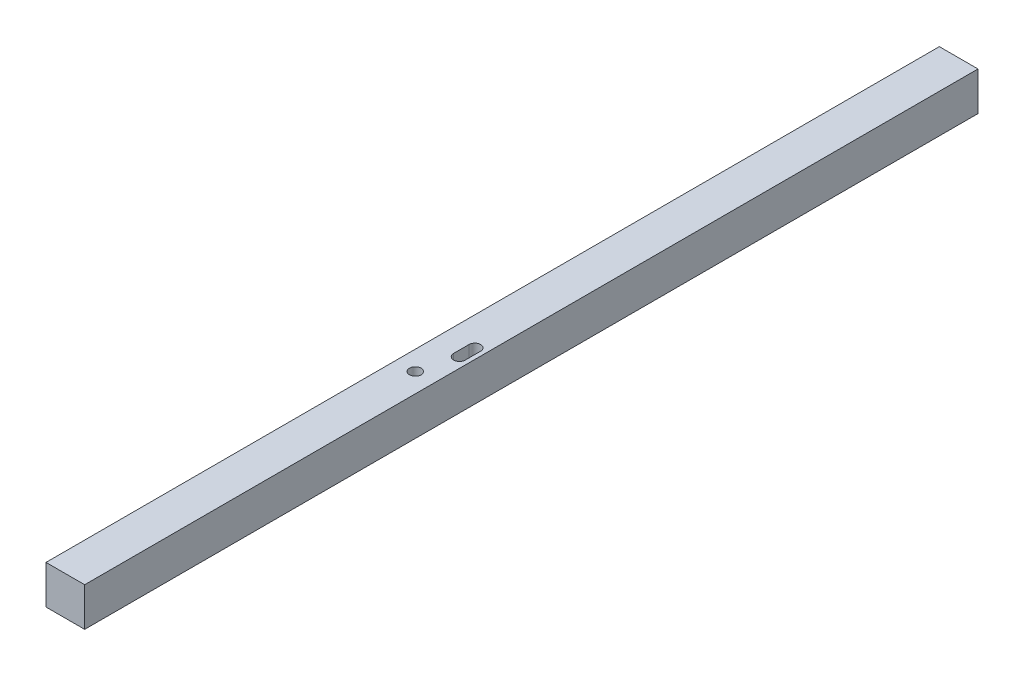
ISO-10303-21;
HEADER;
FILE_DESCRIPTION(('STEP AP214'),'2;1');
FILE_NAME('part.step','',(''),(''),'','','');
FILE_SCHEMA(('AUTOMOTIVE_DESIGN { 1 0 10303 214 1 1 1 1 }'));
ENDSEC;
DATA;
#1=APPLICATION_CONTEXT('core data for automotive mechanical design processes');
#2=APPLICATION_PROTOCOL_DEFINITION('international standard','automotive_design',2000,#1);
#3=PRODUCT_CONTEXT('',#1,'mechanical');
#4=PRODUCT('Part','Part','',(#3));
#5=PRODUCT_RELATED_PRODUCT_CATEGORY('part','',(#4));
#6=PRODUCT_DEFINITION_FORMATION('','',#4);
#7=PRODUCT_DEFINITION_CONTEXT('part definition',#1,'design');
#8=PRODUCT_DEFINITION('design','',#6,#7);
#9=PRODUCT_DEFINITION_SHAPE('','',#8);
#10=(LENGTH_UNIT() NAMED_UNIT(*) SI_UNIT(.MILLI.,.METRE.));
#11=(NAMED_UNIT(*) PLANE_ANGLE_UNIT() SI_UNIT($,.RADIAN.));
#12=(NAMED_UNIT(*) SI_UNIT($,.STERADIAN.) SOLID_ANGLE_UNIT());
#13=UNCERTAINTY_MEASURE_WITH_UNIT(LENGTH_MEASURE(1.E-05),#10,'distance_accuracy_value','');
#14=(GEOMETRIC_REPRESENTATION_CONTEXT(3) GLOBAL_UNCERTAINTY_ASSIGNED_CONTEXT((#13)) GLOBAL_UNIT_ASSIGNED_CONTEXT((#10,
#11,#12)) REPRESENTATION_CONTEXT('',''));
#15=CARTESIAN_POINT('',(0.,0.,0.));
#16=DIRECTION('',(0.,0.,1.));
#17=DIRECTION('',(1.,0.,0.));
#18=AXIS2_PLACEMENT_3D('',#15,#16,#17);
#19=CARTESIAN_POINT('',(-5.,5.,131.642135623731));
#20=DIRECTION('',(0.,-1.,0.));
#21=DIRECTION('',(0.,0.,-1.));
#22=AXIS2_PLACEMENT_3D('',#19,#20,#21);
#23=PLANE('',#22);
#24=DIRECTION('',(0.,0.,-1.));
#25=VECTOR('',#24,1.);
#26=CARTESIAN_POINT('',(0.899999999999777,5.,12.));
#27=LINE('',#26,#25);
#28=CARTESIAN_POINT('',(0.899999999999777,5.,16.));
#29=VERTEX_POINT('',#28);
#30=CARTESIAN_POINT('',(0.899999999999777,5.,12.));
#31=VERTEX_POINT('',#30);
#32=EDGE_CURVE('E123',#29,#31,#27,.T.);
#33=ORIENTED_EDGE('',*,*,#32,.T.);
#34=CARTESIAN_POINT('',(2.39999999999978,5.,12.));
#35=DIRECTION('',(0.,-1.,0.));
#36=DIRECTION('',(0.,0.,-1.));
#37=AXIS2_PLACEMENT_3D('',#34,#35,#36);
#38=CIRCLE('',#37,1.5);
#39=CARTESIAN_POINT('',(3.89999999999978,5.,12.));
#40=VERTEX_POINT('',#39);
#41=EDGE_CURVE('E117',#31,#40,#38,.T.);
#42=ORIENTED_EDGE('',*,*,#41,.T.);
#43=DIRECTION('',(0.,0.,1.));
#44=VECTOR('',#43,1.);
#45=CARTESIAN_POINT('',(3.89999999999978,5.,12.));
#46=LINE('',#45,#44);
#47=CARTESIAN_POINT('',(3.89999999999978,5.,16.));
#48=VERTEX_POINT('',#47);
#49=EDGE_CURVE('E126',#40,#48,#46,.T.);
#50=ORIENTED_EDGE('',*,*,#49,.T.);
#51=CARTESIAN_POINT('',(2.39999999999978,5.,16.));
#52=DIRECTION('',(0.,-1.,0.));
#53=DIRECTION('',(0.,0.,-1.));
#54=AXIS2_PLACEMENT_3D('',#51,#52,#53);
#55=CIRCLE('',#54,1.5);
#56=EDGE_CURVE('E65',#48,#29,#55,.T.);
#57=ORIENTED_EDGE('',*,*,#56,.T.);
#58=EDGE_LOOP('',(#33,#42,#50,#57));
#59=FACE_BOUND('',#58,.T.);
#60=CARTESIAN_POINT('',(0.,5.,25.));
#61=DIRECTION('',(0.,-1.,0.));
#62=DIRECTION('',(0.,0.,-1.));
#63=AXIS2_PLACEMENT_3D('',#60,#61,#62);
#64=CIRCLE('',#63,1.5);
#65=CARTESIAN_POINT('',(0.,5.,23.5));
#66=VERTEX_POINT('',#65);
#67=EDGE_CURVE('E151',#66,#66,#64,.T.);
#68=ORIENTED_EDGE('',*,*,#67,.T.);
#69=EDGE_LOOP('',(#68));
#70=FACE_BOUND('',#69,.T.);
#71=DIRECTION('',(0.,0.,-1.));
#72=VECTOR('',#71,1.);
#73=CARTESIAN_POINT('',(-5.,5.,131.642135623731));
#74=LINE('',#73,#72);
#75=CARTESIAN_POINT('',(-5.,5.,115.5));
#76=VERTEX_POINT('',#75);
#77=CARTESIAN_POINT('',(-5.,5.,-115.5));
#78=VERTEX_POINT('',#77);
#79=EDGE_CURVE('E168',#76,#78,#74,.T.);
#80=ORIENTED_EDGE('',*,*,#79,.F.);
#81=DIRECTION('',(1.,0.,0.));
#82=VECTOR('',#81,1.);
#83=CARTESIAN_POINT('',(-5.,5.,115.5));
#84=LINE('',#83,#82);
#85=CARTESIAN_POINT('',(5.,5.,115.5));
#86=VERTEX_POINT('',#85);
#87=EDGE_CURVE('E52',#76,#86,#84,.T.);
#88=ORIENTED_EDGE('',*,*,#87,.T.);
#89=DIRECTION('',(0.,0.,-1.));
#90=VECTOR('',#89,1.);
#91=CARTESIAN_POINT('',(5.,5.,131.642135623731));
#92=LINE('',#91,#90);
#93=CARTESIAN_POINT('',(5.,5.,-115.5));
#94=VERTEX_POINT('',#93);
#95=EDGE_CURVE('E175',#86,#94,#92,.T.);
#96=ORIENTED_EDGE('',*,*,#95,.T.);
#97=DIRECTION('',(1.,0.,0.));
#98=VECTOR('',#97,1.);
#99=CARTESIAN_POINT('',(-5.,5.,-115.5));
#100=LINE('',#99,#98);
#101=EDGE_CURVE('E159',#78,#94,#100,.T.);
#102=ORIENTED_EDGE('',*,*,#101,.F.);
#103=EDGE_LOOP('',(#80,#88,#96,#102));
#104=FACE_BOUND('',#103,.T.);
#105=ADVANCED_FACE('F48',(#59,#70,#104),#23,.F.);
#106=CARTESIAN_POINT('',(5.,5.,131.642135623731));
#107=DIRECTION('',(-1.,0.,0.));
#108=DIRECTION('',(0.,-1.,0.));
#109=AXIS2_PLACEMENT_3D('',#106,#107,#108);
#110=PLANE('',#109);
#111=ORIENTED_EDGE('',*,*,#95,.F.);
#112=DIRECTION('',(0.,-1.,0.));
#113=VECTOR('',#112,1.);
#114=CARTESIAN_POINT('',(5.,5.,115.5));
#115=LINE('',#114,#113);
#116=CARTESIAN_POINT('',(5.,-5.,115.5));
#117=VERTEX_POINT('',#116);
#118=EDGE_CURVE('E169',#86,#117,#115,.T.);
#119=ORIENTED_EDGE('',*,*,#118,.T.);
#120=DIRECTION('',(0.,0.,-1.));
#121=VECTOR('',#120,1.);
#122=CARTESIAN_POINT('',(5.,-5.,131.642135623731));
#123=LINE('',#122,#121);
#124=CARTESIAN_POINT('',(5.,-5.,-115.5));
#125=VERTEX_POINT('',#124);
#126=EDGE_CURVE('E177',#117,#125,#123,.T.);
#127=ORIENTED_EDGE('',*,*,#126,.T.);
#128=DIRECTION('',(0.,-1.,0.));
#129=VECTOR('',#128,1.);
#130=CARTESIAN_POINT('',(5.,4.99999999999999,-115.5));
#131=LINE('',#130,#129);
#132=EDGE_CURVE('E154',#94,#125,#131,.T.);
#133=ORIENTED_EDGE('',*,*,#132,.F.);
#134=EDGE_LOOP('',(#111,#119,#127,#133));
#135=FACE_BOUND('',#134,.T.);
#136=ADVANCED_FACE('F195',(#135),#110,.F.);
#137=CARTESIAN_POINT('',(-5.,-5.,131.642135623731));
#138=DIRECTION('',(0.,1.,0.));
#139=DIRECTION('',(0.,0.,1.));
#140=AXIS2_PLACEMENT_3D('',#137,#138,#139);
#141=PLANE('',#140);
#142=DIRECTION('',(0.,0.,1.));
#143=VECTOR('',#142,1.);
#144=CARTESIAN_POINT('',(3.89999999999978,-5.,12.));
#145=LINE('',#144,#143);
#146=CARTESIAN_POINT('',(3.89999999999978,-5.,12.));
#147=VERTEX_POINT('',#146);
#148=CARTESIAN_POINT('',(3.89999999999978,-5.,16.));
#149=VERTEX_POINT('',#148);
#150=EDGE_CURVE('E141',#147,#149,#145,.T.);
#151=ORIENTED_EDGE('',*,*,#150,.F.);
#152=CARTESIAN_POINT('',(2.39999999999978,-5.,12.));
#153=DIRECTION('',(0.,-1.,0.));
#154=DIRECTION('',(0.,0.,-1.));
#155=AXIS2_PLACEMENT_3D('',#152,#153,#154);
#156=CIRCLE('',#155,1.5);
#157=CARTESIAN_POINT('',(0.899999999999777,-5.,12.));
#158=VERTEX_POINT('',#157);
#159=EDGE_CURVE('E73',#158,#147,#156,.T.);
#160=ORIENTED_EDGE('',*,*,#159,.F.);
#161=DIRECTION('',(0.,0.,-1.));
#162=VECTOR('',#161,1.);
#163=CARTESIAN_POINT('',(0.899999999999777,-5.,12.));
#164=LINE('',#163,#162);
#165=CARTESIAN_POINT('',(0.899999999999777,-5.,16.));
#166=VERTEX_POINT('',#165);
#167=EDGE_CURVE('E132',#166,#158,#164,.T.);
#168=ORIENTED_EDGE('',*,*,#167,.F.);
#169=CARTESIAN_POINT('',(2.39999999999978,-5.,16.));
#170=DIRECTION('',(0.,-1.,0.));
#171=DIRECTION('',(0.,0.,-1.));
#172=AXIS2_PLACEMENT_3D('',#169,#170,#171);
#173=CIRCLE('',#172,1.5);
#174=EDGE_CURVE('E135',#149,#166,#173,.T.);
#175=ORIENTED_EDGE('',*,*,#174,.F.);
#176=EDGE_LOOP('',(#151,#160,#168,#175));
#177=FACE_BOUND('',#176,.T.);
#178=CARTESIAN_POINT('',(0.,-5.,25.));
#179=DIRECTION('',(0.,-1.,0.));
#180=DIRECTION('',(0.,0.,-1.));
#181=AXIS2_PLACEMENT_3D('',#178,#179,#180);
#182=CIRCLE('',#181,1.5);
#183=CARTESIAN_POINT('',(0.,-5.,23.5));
#184=VERTEX_POINT('',#183);
#185=EDGE_CURVE('E147',#184,#184,#182,.T.);
#186=ORIENTED_EDGE('',*,*,#185,.F.);
#187=EDGE_LOOP('',(#186));
#188=FACE_BOUND('',#187,.T.);
#189=ORIENTED_EDGE('',*,*,#126,.F.);
#190=DIRECTION('',(-1.,0.,0.));
#191=VECTOR('',#190,1.);
#192=CARTESIAN_POINT('',(-5.,-5.,115.5));
#193=LINE('',#192,#191);
#194=CARTESIAN_POINT('',(-5.,-5.,115.5));
#195=VERTEX_POINT('',#194);
#196=EDGE_CURVE('E57',#117,#195,#193,.T.);
#197=ORIENTED_EDGE('',*,*,#196,.T.);
#198=DIRECTION('',(0.,0.,-1.));
#199=VECTOR('',#198,1.);
#200=CARTESIAN_POINT('',(-5.,-5.,131.642135623731));
#201=LINE('',#200,#199);
#202=CARTESIAN_POINT('',(-5.,-5.,-115.5));
#203=VERTEX_POINT('',#202);
#204=EDGE_CURVE('E178',#195,#203,#201,.T.);
#205=ORIENTED_EDGE('',*,*,#204,.T.);
#206=DIRECTION('',(-1.,0.,0.));
#207=VECTOR('',#206,1.);
#208=CARTESIAN_POINT('',(-5.,-5.,-115.5));
#209=LINE('',#208,#207);
#210=EDGE_CURVE('E165',#125,#203,#209,.T.);
#211=ORIENTED_EDGE('',*,*,#210,.F.);
#212=EDGE_LOOP('',(#189,#197,#205,#211));
#213=FACE_BOUND('',#212,.T.);
#214=ADVANCED_FACE('F192',(#177,#188,#213),#141,.F.);
#215=CARTESIAN_POINT('',(-5.,5.,131.642135623731));
#216=DIRECTION('',(1.,0.,0.));
#217=DIRECTION('',(0.,1.,0.));
#218=AXIS2_PLACEMENT_3D('',#215,#216,#217);
#219=PLANE('',#218);
#220=ORIENTED_EDGE('',*,*,#204,.F.);
#221=DIRECTION('',(0.,1.,0.));
#222=VECTOR('',#221,1.);
#223=CARTESIAN_POINT('',(-5.,5.,115.5));
#224=LINE('',#223,#222);
#225=EDGE_CURVE('E14',#195,#76,#224,.T.);
#226=ORIENTED_EDGE('',*,*,#225,.T.);
#227=ORIENTED_EDGE('',*,*,#79,.T.);
#228=DIRECTION('',(0.,1.,0.));
#229=VECTOR('',#228,1.);
#230=CARTESIAN_POINT('',(-5.,4.99999999999999,-115.5));
#231=LINE('',#230,#229);
#232=EDGE_CURVE('E162',#203,#78,#231,.T.);
#233=ORIENTED_EDGE('',*,*,#232,.F.);
#234=EDGE_LOOP('',(#220,#226,#227,#233));
#235=FACE_BOUND('',#234,.T.);
#236=ADVANCED_FACE('F50',(#235),#219,.F.);
#237=CARTESIAN_POINT('',(-186.2,5.,115.5));
#238=DIRECTION('',(0.,0.,-1.));
#239=DIRECTION('',(0.,1.,0.));
#240=AXIS2_PLACEMENT_3D('',#237,#238,#239);
#241=PLANE('',#240);
#242=ORIENTED_EDGE('',*,*,#196,.F.);
#243=ORIENTED_EDGE('',*,*,#118,.F.);
#244=ORIENTED_EDGE('',*,*,#87,.F.);
#245=ORIENTED_EDGE('',*,*,#225,.F.);
#246=EDGE_LOOP('',(#242,#243,#244,#245));
#247=FACE_BOUND('',#246,.T.);
#248=ADVANCED_FACE('F188',(#247),#241,.F.);
#249=CARTESIAN_POINT('',(-186.2,-4.99999999999856,-115.5));
#250=DIRECTION('',(0.,0.,1.));
#251=DIRECTION('',(0.,-1.,0.));
#252=AXIS2_PLACEMENT_3D('',#249,#250,#251);
#253=PLANE('',#252);
#254=ORIENTED_EDGE('',*,*,#232,.T.);
#255=ORIENTED_EDGE('',*,*,#101,.T.);
#256=ORIENTED_EDGE('',*,*,#132,.T.);
#257=ORIENTED_EDGE('',*,*,#210,.T.);
#258=EDGE_LOOP('',(#254,#255,#256,#257));
#259=FACE_BOUND('',#258,.T.);
#260=ADVANCED_FACE('F197',(#259),#253,.F.);
#261=CARTESIAN_POINT('',(0.,5.,25.));
#262=DIRECTION('',(0.,-1.,0.));
#263=DIRECTION('',(0.,0.,-1.));
#264=AXIS2_PLACEMENT_3D('',#261,#262,#263);
#265=CYLINDRICAL_SURFACE('',#264,1.5);
#266=ORIENTED_EDGE('',*,*,#67,.F.);
#267=EDGE_LOOP('',(#266));
#268=FACE_BOUND('',#267,.T.);
#269=ORIENTED_EDGE('',*,*,#185,.T.);
#270=EDGE_LOOP('',(#269));
#271=FACE_BOUND('',#270,.T.);
#272=ADVANCED_FACE('F199',(#268,#271),#265,.F.);
#273=CARTESIAN_POINT('',(2.39999999999978,5.,12.));
#274=DIRECTION('',(0.,-1.,0.));
#275=DIRECTION('',(0.,0.,-1.));
#276=AXIS2_PLACEMENT_3D('',#273,#274,#275);
#277=CYLINDRICAL_SURFACE('',#276,1.5);
#278=ORIENTED_EDGE('',*,*,#159,.T.);
#279=DIRECTION('',(0.,-1.,0.));
#280=VECTOR('',#279,1.);
#281=CARTESIAN_POINT('',(3.89999999999978,5.,12.));
#282=LINE('',#281,#280);
#283=EDGE_CURVE('E113',#40,#147,#282,.T.);
#284=ORIENTED_EDGE('',*,*,#283,.F.);
#285=ORIENTED_EDGE('',*,*,#41,.F.);
#286=DIRECTION('',(0.,-1.,0.));
#287=VECTOR('',#286,1.);
#288=CARTESIAN_POINT('',(0.899999999999777,5.,12.));
#289=LINE('',#288,#287);
#290=EDGE_CURVE('E145',#31,#158,#289,.T.);
#291=ORIENTED_EDGE('',*,*,#290,.T.);
#292=EDGE_LOOP('',(#278,#284,#285,#291));
#293=FACE_BOUND('',#292,.T.);
#294=ADVANCED_FACE('F115',(#293),#277,.F.);
#295=CARTESIAN_POINT('',(0.899999999999777,5.,12.));
#296=DIRECTION('',(-1.,0.,0.));
#297=DIRECTION('',(0.,0.,1.));
#298=AXIS2_PLACEMENT_3D('',#295,#296,#297);
#299=PLANE('',#298);
#300=ORIENTED_EDGE('',*,*,#167,.T.);
#301=ORIENTED_EDGE('',*,*,#290,.F.);
#302=ORIENTED_EDGE('',*,*,#32,.F.);
#303=DIRECTION('',(0.,-1.,0.));
#304=VECTOR('',#303,1.);
#305=CARTESIAN_POINT('',(0.899999999999777,5.,16.));
#306=LINE('',#305,#304);
#307=EDGE_CURVE('E148',#29,#166,#306,.T.);
#308=ORIENTED_EDGE('',*,*,#307,.T.);
#309=EDGE_LOOP('',(#300,#301,#302,#308));
#310=FACE_BOUND('',#309,.T.);
#311=ADVANCED_FACE('F226',(#310),#299,.F.);
#312=CARTESIAN_POINT('',(2.39999999999978,5.,16.));
#313=DIRECTION('',(0.,-1.,0.));
#314=DIRECTION('',(0.,0.,-1.));
#315=AXIS2_PLACEMENT_3D('',#312,#313,#314);
#316=CYLINDRICAL_SURFACE('',#315,1.5);
#317=ORIENTED_EDGE('',*,*,#174,.T.);
#318=ORIENTED_EDGE('',*,*,#307,.F.);
#319=ORIENTED_EDGE('',*,*,#56,.F.);
#320=DIRECTION('',(0.,-1.,0.));
#321=VECTOR('',#320,1.);
#322=CARTESIAN_POINT('',(3.89999999999978,5.,16.));
#323=LINE('',#322,#321);
#324=EDGE_CURVE('E122',#48,#149,#323,.T.);
#325=ORIENTED_EDGE('',*,*,#324,.T.);
#326=EDGE_LOOP('',(#317,#318,#319,#325));
#327=FACE_BOUND('',#326,.T.);
#328=ADVANCED_FACE('F224',(#327),#316,.F.);
#329=CARTESIAN_POINT('',(3.89999999999978,5.,12.));
#330=DIRECTION('',(1.,0.,0.));
#331=DIRECTION('',(0.,0.,-1.));
#332=AXIS2_PLACEMENT_3D('',#329,#330,#331);
#333=PLANE('',#332);
#334=ORIENTED_EDGE('',*,*,#150,.T.);
#335=ORIENTED_EDGE('',*,*,#324,.F.);
#336=ORIENTED_EDGE('',*,*,#49,.F.);
#337=ORIENTED_EDGE('',*,*,#283,.T.);
#338=EDGE_LOOP('',(#334,#335,#336,#337));
#339=FACE_BOUND('',#338,.T.);
#340=ADVANCED_FACE('F127',(#339),#333,.F.);
#341=CLOSED_SHELL('',(#105,#136,#214,#236,#248,#260,#272,#294,#311,#328,#340));
#342=MANIFOLD_SOLID_BREP('B2',#341);
#343=ADVANCED_BREP_SHAPE_REPRESENTATION('',(#18,#342),#14);
#344=SHAPE_DEFINITION_REPRESENTATION(#9,#343);
ENDSEC;
END-ISO-10303-21;
